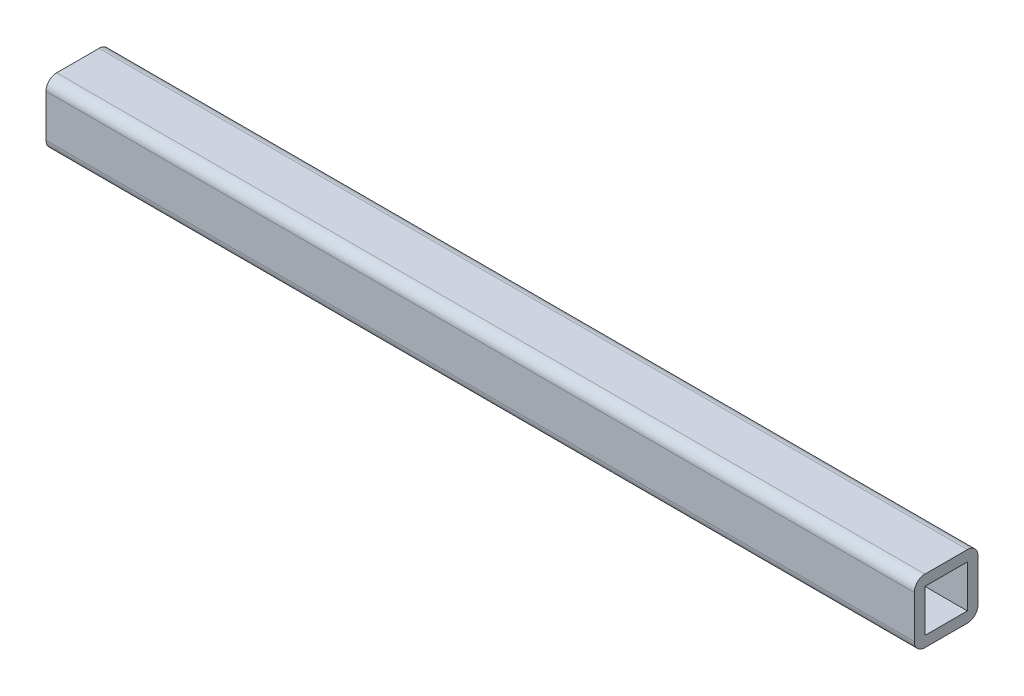
ISO-10303-21;
HEADER;
FILE_DESCRIPTION(('STEP AP214'),'2;1');
FILE_NAME('part.step','',(''),(''),'','','');
FILE_SCHEMA(('AUTOMOTIVE_DESIGN { 1 0 10303 214 1 1 1 1 }'));
ENDSEC;
DATA;
#1=APPLICATION_CONTEXT('core data for automotive mechanical design processes');
#2=APPLICATION_PROTOCOL_DEFINITION('international standard','automotive_design',2000,#1);
#3=PRODUCT_CONTEXT('',#1,'mechanical');
#4=PRODUCT('Part','Part','',(#3));
#5=PRODUCT_RELATED_PRODUCT_CATEGORY('part','',(#4));
#6=PRODUCT_DEFINITION_FORMATION('','',#4);
#7=PRODUCT_DEFINITION_CONTEXT('part definition',#1,'design');
#8=PRODUCT_DEFINITION('design','',#6,#7);
#9=PRODUCT_DEFINITION_SHAPE('','',#8);
#10=(LENGTH_UNIT() NAMED_UNIT(*) SI_UNIT(.MILLI.,.METRE.));
#11=(NAMED_UNIT(*) PLANE_ANGLE_UNIT() SI_UNIT($,.RADIAN.));
#12=(NAMED_UNIT(*) SI_UNIT($,.STERADIAN.) SOLID_ANGLE_UNIT());
#13=UNCERTAINTY_MEASURE_WITH_UNIT(LENGTH_MEASURE(1.E-05),#10,'distance_accuracy_value','');
#14=(GEOMETRIC_REPRESENTATION_CONTEXT(3) GLOBAL_UNCERTAINTY_ASSIGNED_CONTEXT((#13)) GLOBAL_UNIT_ASSIGNED_CONTEXT((#10,
#11,#12)) REPRESENTATION_CONTEXT('',''));
#15=CARTESIAN_POINT('',(0.,0.,0.));
#16=DIRECTION('',(0.,0.,1.));
#17=DIRECTION('',(1.,0.,0.));
#18=AXIS2_PLACEMENT_3D('',#15,#16,#17);
#19=CARTESIAN_POINT('',(259.55625,0.,0.));
#20=DIRECTION('',(-1.,0.,0.));
#21=DIRECTION('',(0.,0.,1.));
#22=AXIS2_PLACEMENT_3D('',#19,#20,#21);
#23=PLANE('',#22);
#24=DIRECTION('',(0.,0.,-1.));
#25=VECTOR('',#24,1.);
#26=CARTESIAN_POINT('',(259.55625,-19.05,19.05));
#27=LINE('',#26,#25);
#28=CARTESIAN_POINT('',(259.55625,-19.05,12.7));
#29=VERTEX_POINT('',#28);
#30=CARTESIAN_POINT('',(259.55625,-19.05,-12.7));
#31=VERTEX_POINT('',#30);
#32=EDGE_CURVE('E204',#29,#31,#27,.T.);
#33=ORIENTED_EDGE('',*,*,#32,.T.);
#34=CARTESIAN_POINT('',(259.55625,-12.7,-12.7));
#35=DIRECTION('',(-1.,0.,0.));
#36=DIRECTION('',(0.,0.,1.));
#37=AXIS2_PLACEMENT_3D('',#34,#35,#36);
#38=CIRCLE('',#37,6.35);
#39=CARTESIAN_POINT('',(259.55625,-12.7,-19.05));
#40=VERTEX_POINT('',#39);
#41=EDGE_CURVE('E255',#31,#40,#38,.F.);
#42=ORIENTED_EDGE('',*,*,#41,.T.);
#43=DIRECTION('',(0.,1.,0.));
#44=VECTOR('',#43,1.);
#45=CARTESIAN_POINT('',(259.55625,-19.05,-19.05));
#46=LINE('',#45,#44);
#47=CARTESIAN_POINT('',(259.55625,12.7,-19.05));
#48=VERTEX_POINT('',#47);
#49=EDGE_CURVE('E193',#40,#48,#46,.T.);
#50=ORIENTED_EDGE('',*,*,#49,.T.);
#51=CARTESIAN_POINT('',(259.55625,12.7,-12.7));
#52=DIRECTION('',(-1.,0.,0.));
#53=DIRECTION('',(0.,0.,1.));
#54=AXIS2_PLACEMENT_3D('',#51,#52,#53);
#55=CIRCLE('',#54,6.35);
#56=CARTESIAN_POINT('',(259.55625,19.05,-12.7));
#57=VERTEX_POINT('',#56);
#58=EDGE_CURVE('E249',#48,#57,#55,.F.);
#59=ORIENTED_EDGE('',*,*,#58,.T.);
#60=DIRECTION('',(0.,0.,1.));
#61=VECTOR('',#60,1.);
#62=CARTESIAN_POINT('',(259.55625,19.05,19.05));
#63=LINE('',#62,#61);
#64=CARTESIAN_POINT('',(259.55625,19.05,12.7));
#65=VERTEX_POINT('',#64);
#66=EDGE_CURVE('E197',#57,#65,#63,.T.);
#67=ORIENTED_EDGE('',*,*,#66,.T.);
#68=CARTESIAN_POINT('',(259.55625,12.7,12.7));
#69=DIRECTION('',(-1.,0.,0.));
#70=DIRECTION('',(0.,0.,1.));
#71=AXIS2_PLACEMENT_3D('',#68,#69,#70);
#72=CIRCLE('',#71,6.35);
#73=CARTESIAN_POINT('',(259.55625,12.7,19.05));
#74=VERTEX_POINT('',#73);
#75=EDGE_CURVE('E70',#65,#74,#72,.F.);
#76=ORIENTED_EDGE('',*,*,#75,.T.);
#77=DIRECTION('',(0.,-1.,0.));
#78=VECTOR('',#77,1.);
#79=CARTESIAN_POINT('',(259.55625,-19.05,19.05));
#80=LINE('',#79,#78);
#81=CARTESIAN_POINT('',(259.55625,-12.7,19.05));
#82=VERTEX_POINT('',#81);
#83=EDGE_CURVE('E201',#74,#82,#80,.T.);
#84=ORIENTED_EDGE('',*,*,#83,.T.);
#85=CARTESIAN_POINT('',(259.55625,-12.7,12.7));
#86=DIRECTION('',(-1.,0.,0.));
#87=DIRECTION('',(0.,0.,1.));
#88=AXIS2_PLACEMENT_3D('',#85,#86,#87);
#89=CIRCLE('',#88,6.35);
#90=EDGE_CURVE('E252',#82,#29,#89,.F.);
#91=ORIENTED_EDGE('',*,*,#90,.T.);
#92=EDGE_LOOP('',(#33,#42,#50,#59,#67,#76,#84,#91));
#93=FACE_BOUND('',#92,.T.);
#94=DIRECTION('',(0.,1.,0.));
#95=VECTOR('',#94,1.);
#96=CARTESIAN_POINT('',(259.55625,-12.7,-12.7));
#97=LINE('',#96,#95);
#98=CARTESIAN_POINT('',(259.55625,-12.7,-12.7));
#99=VERTEX_POINT('',#98);
#100=CARTESIAN_POINT('',(259.55625,12.7,-12.7));
#101=VERTEX_POINT('',#100);
#102=EDGE_CURVE('E140',#99,#101,#97,.T.);
#103=ORIENTED_EDGE('',*,*,#102,.F.);
#104=DIRECTION('',(0.,0.,-1.));
#105=VECTOR('',#104,1.);
#106=CARTESIAN_POINT('',(259.55625,-12.7,12.7));
#107=LINE('',#106,#105);
#108=CARTESIAN_POINT('',(259.55625,-12.7,12.7));
#109=VERTEX_POINT('',#108);
#110=EDGE_CURVE('E169',#109,#99,#107,.T.);
#111=ORIENTED_EDGE('',*,*,#110,.F.);
#112=DIRECTION('',(0.,-1.,0.));
#113=VECTOR('',#112,1.);
#114=CARTESIAN_POINT('',(259.55625,-12.7,12.7));
#115=LINE('',#114,#113);
#116=CARTESIAN_POINT('',(259.55625,12.7,12.7));
#117=VERTEX_POINT('',#116);
#118=EDGE_CURVE('E165',#117,#109,#115,.T.);
#119=ORIENTED_EDGE('',*,*,#118,.F.);
#120=DIRECTION('',(0.,0.,1.));
#121=VECTOR('',#120,1.);
#122=CARTESIAN_POINT('',(259.55625,12.7,12.7));
#123=LINE('',#122,#121);
#124=EDGE_CURVE('E151',#101,#117,#123,.T.);
#125=ORIENTED_EDGE('',*,*,#124,.F.);
#126=EDGE_LOOP('',(#103,#111,#119,#125));
#127=FACE_BOUND('',#126,.T.);
#128=ADVANCED_FACE('F47',(#93,#127),#23,.F.);
#129=CARTESIAN_POINT('',(-259.55625,0.,0.));
#130=DIRECTION('',(-1.,0.,0.));
#131=DIRECTION('',(0.,0.,1.));
#132=AXIS2_PLACEMENT_3D('',#129,#130,#131);
#133=PLANE('',#132);
#134=DIRECTION('',(0.,1.,0.));
#135=VECTOR('',#134,1.);
#136=CARTESIAN_POINT('',(-259.55625,-19.05,-19.05));
#137=LINE('',#136,#135);
#138=CARTESIAN_POINT('',(-259.55625,-12.7,-19.05));
#139=VERTEX_POINT('',#138);
#140=CARTESIAN_POINT('',(-259.55625,12.7,-19.05));
#141=VERTEX_POINT('',#140);
#142=EDGE_CURVE('E160',#139,#141,#137,.T.);
#143=ORIENTED_EDGE('',*,*,#142,.F.);
#144=CARTESIAN_POINT('',(-259.55625,-12.7,-12.7));
#145=DIRECTION('',(-1.,0.,0.));
#146=DIRECTION('',(0.,0.,1.));
#147=AXIS2_PLACEMENT_3D('',#144,#145,#146);
#148=CIRCLE('',#147,6.35);
#149=CARTESIAN_POINT('',(-259.55625,-19.05,-12.7));
#150=VERTEX_POINT('',#149);
#151=EDGE_CURVE('E237',#139,#150,#148,.T.);
#152=ORIENTED_EDGE('',*,*,#151,.T.);
#153=DIRECTION('',(0.,0.,-1.));
#154=VECTOR('',#153,1.);
#155=CARTESIAN_POINT('',(-259.55625,-19.05,19.05));
#156=LINE('',#155,#154);
#157=CARTESIAN_POINT('',(-259.55625,-19.05,12.7));
#158=VERTEX_POINT('',#157);
#159=EDGE_CURVE('E198',#158,#150,#156,.T.);
#160=ORIENTED_EDGE('',*,*,#159,.F.);
#161=CARTESIAN_POINT('',(-259.55625,-12.7,12.7));
#162=DIRECTION('',(-1.,0.,0.));
#163=DIRECTION('',(0.,0.,1.));
#164=AXIS2_PLACEMENT_3D('',#161,#162,#163);
#165=CIRCLE('',#164,6.35);
#166=CARTESIAN_POINT('',(-259.55625,-12.7,19.05));
#167=VERTEX_POINT('',#166);
#168=EDGE_CURVE('E234',#158,#167,#165,.T.);
#169=ORIENTED_EDGE('',*,*,#168,.T.);
#170=DIRECTION('',(0.,-1.,0.));
#171=VECTOR('',#170,1.);
#172=CARTESIAN_POINT('',(-259.55625,-19.05,19.05));
#173=LINE('',#172,#171);
#174=CARTESIAN_POINT('',(-259.55625,12.7,19.05));
#175=VERTEX_POINT('',#174);
#176=EDGE_CURVE('E216',#175,#167,#173,.T.);
#177=ORIENTED_EDGE('',*,*,#176,.F.);
#178=CARTESIAN_POINT('',(-259.55625,12.7,12.7));
#179=DIRECTION('',(-1.,0.,0.));
#180=DIRECTION('',(0.,0.,1.));
#181=AXIS2_PLACEMENT_3D('',#178,#179,#180);
#182=CIRCLE('',#181,6.35);
#183=CARTESIAN_POINT('',(-259.55625,19.05,12.7));
#184=VERTEX_POINT('',#183);
#185=EDGE_CURVE('E228',#175,#184,#182,.T.);
#186=ORIENTED_EDGE('',*,*,#185,.T.);
#187=DIRECTION('',(0.,0.,1.));
#188=VECTOR('',#187,1.);
#189=CARTESIAN_POINT('',(-259.55625,19.05,19.05));
#190=LINE('',#189,#188);
#191=CARTESIAN_POINT('',(-259.55625,19.05,-12.7));
#192=VERTEX_POINT('',#191);
#193=EDGE_CURVE('E212',#192,#184,#190,.T.);
#194=ORIENTED_EDGE('',*,*,#193,.F.);
#195=CARTESIAN_POINT('',(-259.55625,12.7,-12.7));
#196=DIRECTION('',(-1.,0.,0.));
#197=DIRECTION('',(0.,0.,1.));
#198=AXIS2_PLACEMENT_3D('',#195,#196,#197);
#199=CIRCLE('',#198,6.35);
#200=EDGE_CURVE('E231',#192,#141,#199,.T.);
#201=ORIENTED_EDGE('',*,*,#200,.T.);
#202=EDGE_LOOP('',(#143,#152,#160,#169,#177,#186,#194,#201));
#203=FACE_BOUND('',#202,.T.);
#204=DIRECTION('',(0.,0.,-1.));
#205=VECTOR('',#204,1.);
#206=CARTESIAN_POINT('',(-259.55625,-12.7,12.7));
#207=LINE('',#206,#205);
#208=CARTESIAN_POINT('',(-259.55625,-12.7,12.7));
#209=VERTEX_POINT('',#208);
#210=CARTESIAN_POINT('',(-259.55625,-12.7,-12.7));
#211=VERTEX_POINT('',#210);
#212=EDGE_CURVE('E152',#209,#211,#207,.T.);
#213=ORIENTED_EDGE('',*,*,#212,.T.);
#214=DIRECTION('',(0.,1.,0.));
#215=VECTOR('',#214,1.);
#216=CARTESIAN_POINT('',(-259.55625,-12.7,-12.7));
#217=LINE('',#216,#215);
#218=CARTESIAN_POINT('',(-259.55625,12.7,-12.7));
#219=VERTEX_POINT('',#218);
#220=EDGE_CURVE('E174',#211,#219,#217,.T.);
#221=ORIENTED_EDGE('',*,*,#220,.T.);
#222=DIRECTION('',(0.,0.,1.));
#223=VECTOR('',#222,1.);
#224=CARTESIAN_POINT('',(-259.55625,12.7,12.7));
#225=LINE('',#224,#223);
#226=CARTESIAN_POINT('',(-259.55625,12.7,12.7));
#227=VERTEX_POINT('',#226);
#228=EDGE_CURVE('E158',#219,#227,#225,.T.);
#229=ORIENTED_EDGE('',*,*,#228,.T.);
#230=DIRECTION('',(0.,-1.,0.));
#231=VECTOR('',#230,1.);
#232=CARTESIAN_POINT('',(-259.55625,-12.7,12.7));
#233=LINE('',#232,#231);
#234=EDGE_CURVE('E179',#227,#209,#233,.T.);
#235=ORIENTED_EDGE('',*,*,#234,.T.);
#236=EDGE_LOOP('',(#213,#221,#229,#235));
#237=FACE_BOUND('',#236,.T.);
#238=ADVANCED_FACE('F277',(#203,#237),#133,.T.);
#239=CARTESIAN_POINT('',(259.55625,-19.05,-19.05));
#240=DIRECTION('',(0.,0.,1.));
#241=DIRECTION('',(1.,0.,0.));
#242=AXIS2_PLACEMENT_3D('',#239,#240,#241);
#243=PLANE('',#242);
#244=ORIENTED_EDGE('',*,*,#49,.F.);
#245=DIRECTION('',(-1.,0.,0.));
#246=VECTOR('',#245,1.);
#247=CARTESIAN_POINT('',(259.55625,-12.7,-19.05));
#248=LINE('',#247,#246);
#249=EDGE_CURVE('E224',#40,#139,#248,.T.);
#250=ORIENTED_EDGE('',*,*,#249,.T.);
#251=ORIENTED_EDGE('',*,*,#142,.T.);
#252=DIRECTION('',(-1.,0.,0.));
#253=VECTOR('',#252,1.);
#254=CARTESIAN_POINT('',(259.55625,12.7,-19.05));
#255=LINE('',#254,#253);
#256=EDGE_CURVE('E208',#141,#48,#255,.F.);
#257=ORIENTED_EDGE('',*,*,#256,.T.);
#258=EDGE_LOOP('',(#244,#250,#251,#257));
#259=FACE_BOUND('',#258,.T.);
#260=ADVANCED_FACE('F294',(#259),#243,.F.);
#261=CARTESIAN_POINT('',(259.55625,19.05,19.05));
#262=DIRECTION('',(0.,-1.,0.));
#263=DIRECTION('',(0.,0.,-1.));
#264=AXIS2_PLACEMENT_3D('',#261,#262,#263);
#265=PLANE('',#264);
#266=ORIENTED_EDGE('',*,*,#66,.F.);
#267=DIRECTION('',(-1.,0.,0.));
#268=VECTOR('',#267,1.);
#269=CARTESIAN_POINT('',(259.55625,19.05,-12.7));
#270=LINE('',#269,#268);
#271=EDGE_CURVE('E11',#57,#192,#270,.T.);
#272=ORIENTED_EDGE('',*,*,#271,.T.);
#273=ORIENTED_EDGE('',*,*,#193,.T.);
#274=DIRECTION('',(-1.,0.,0.));
#275=VECTOR('',#274,1.);
#276=CARTESIAN_POINT('',(259.55625,19.05,12.7));
#277=LINE('',#276,#275);
#278=EDGE_CURVE('E56',#184,#65,#277,.F.);
#279=ORIENTED_EDGE('',*,*,#278,.T.);
#280=EDGE_LOOP('',(#266,#272,#273,#279));
#281=FACE_BOUND('',#280,.T.);
#282=ADVANCED_FACE('F267',(#281),#265,.F.);
#283=CARTESIAN_POINT('',(259.55625,-19.05,19.05));
#284=DIRECTION('',(0.,0.,-1.));
#285=DIRECTION('',(-1.,0.,0.));
#286=AXIS2_PLACEMENT_3D('',#283,#284,#285);
#287=PLANE('',#286);
#288=ORIENTED_EDGE('',*,*,#176,.T.);
#289=DIRECTION('',(-1.,0.,0.));
#290=VECTOR('',#289,1.);
#291=CARTESIAN_POINT('',(259.55625,-12.7,19.05));
#292=LINE('',#291,#290);
#293=EDGE_CURVE('E63',#167,#82,#292,.F.);
#294=ORIENTED_EDGE('',*,*,#293,.T.);
#295=ORIENTED_EDGE('',*,*,#83,.F.);
#296=DIRECTION('',(-1.,0.,0.));
#297=VECTOR('',#296,1.);
#298=CARTESIAN_POINT('',(259.55625,12.7,19.05));
#299=LINE('',#298,#297);
#300=EDGE_CURVE('E258',#74,#175,#299,.T.);
#301=ORIENTED_EDGE('',*,*,#300,.T.);
#302=EDGE_LOOP('',(#288,#294,#295,#301));
#303=FACE_BOUND('',#302,.T.);
#304=ADVANCED_FACE('F274',(#303),#287,.F.);
#305=CARTESIAN_POINT('',(259.55625,-19.05,19.05));
#306=DIRECTION('',(0.,1.,0.));
#307=DIRECTION('',(0.,0.,1.));
#308=AXIS2_PLACEMENT_3D('',#305,#306,#307);
#309=PLANE('',#308);
#310=ORIENTED_EDGE('',*,*,#159,.T.);
#311=DIRECTION('',(-1.,0.,0.));
#312=VECTOR('',#311,1.);
#313=CARTESIAN_POINT('',(259.55625,-19.05,-12.7));
#314=LINE('',#313,#312);
#315=EDGE_CURVE('E244',#150,#31,#314,.F.);
#316=ORIENTED_EDGE('',*,*,#315,.T.);
#317=ORIENTED_EDGE('',*,*,#32,.F.);
#318=DIRECTION('',(-1.,0.,0.));
#319=VECTOR('',#318,1.);
#320=CARTESIAN_POINT('',(259.55625,-19.05,12.7));
#321=LINE('',#320,#319);
#322=EDGE_CURVE('E240',#29,#158,#321,.T.);
#323=ORIENTED_EDGE('',*,*,#322,.T.);
#324=EDGE_LOOP('',(#310,#316,#317,#323));
#325=FACE_BOUND('',#324,.T.);
#326=ADVANCED_FACE('F286',(#325),#309,.F.);
#327=CARTESIAN_POINT('',(259.55625,-12.7,-12.7));
#328=DIRECTION('',(0.,0.,1.));
#329=DIRECTION('',(1.,0.,0.));
#330=AXIS2_PLACEMENT_3D('',#327,#328,#329);
#331=PLANE('',#330);
#332=ORIENTED_EDGE('',*,*,#220,.F.);
#333=DIRECTION('',(-1.,0.,0.));
#334=VECTOR('',#333,1.);
#335=CARTESIAN_POINT('',(259.55625,-12.7,-12.7));
#336=LINE('',#335,#334);
#337=EDGE_CURVE('E146',#99,#211,#336,.T.);
#338=ORIENTED_EDGE('',*,*,#337,.F.);
#339=ORIENTED_EDGE('',*,*,#102,.T.);
#340=DIRECTION('',(-1.,0.,0.));
#341=VECTOR('',#340,1.);
#342=CARTESIAN_POINT('',(259.55625,12.7,-12.7));
#343=LINE('',#342,#341);
#344=EDGE_CURVE('E143',#101,#219,#343,.T.);
#345=ORIENTED_EDGE('',*,*,#344,.T.);
#346=EDGE_LOOP('',(#332,#338,#339,#345));
#347=FACE_BOUND('',#346,.T.);
#348=ADVANCED_FACE('F142',(#347),#331,.T.);
#349=CARTESIAN_POINT('',(259.55625,12.7,12.7));
#350=DIRECTION('',(0.,-1.,0.));
#351=DIRECTION('',(0.,0.,-1.));
#352=AXIS2_PLACEMENT_3D('',#349,#350,#351);
#353=PLANE('',#352);
#354=ORIENTED_EDGE('',*,*,#228,.F.);
#355=ORIENTED_EDGE('',*,*,#344,.F.);
#356=ORIENTED_EDGE('',*,*,#124,.T.);
#357=DIRECTION('',(-1.,0.,0.));
#358=VECTOR('',#357,1.);
#359=CARTESIAN_POINT('',(259.55625,12.7,12.7));
#360=LINE('',#359,#358);
#361=EDGE_CURVE('E161',#117,#227,#360,.T.);
#362=ORIENTED_EDGE('',*,*,#361,.T.);
#363=EDGE_LOOP('',(#354,#355,#356,#362));
#364=FACE_BOUND('',#363,.T.);
#365=ADVANCED_FACE('F155',(#364),#353,.T.);
#366=CARTESIAN_POINT('',(259.55625,-12.7,12.7));
#367=DIRECTION('',(0.,0.,-1.));
#368=DIRECTION('',(-1.,0.,0.));
#369=AXIS2_PLACEMENT_3D('',#366,#367,#368);
#370=PLANE('',#369);
#371=ORIENTED_EDGE('',*,*,#234,.F.);
#372=ORIENTED_EDGE('',*,*,#361,.F.);
#373=ORIENTED_EDGE('',*,*,#118,.T.);
#374=DIRECTION('',(-1.,0.,0.));
#375=VECTOR('',#374,1.);
#376=CARTESIAN_POINT('',(259.55625,-12.7,12.7));
#377=LINE('',#376,#375);
#378=EDGE_CURVE('E188',#109,#209,#377,.T.);
#379=ORIENTED_EDGE('',*,*,#378,.T.);
#380=EDGE_LOOP('',(#371,#372,#373,#379));
#381=FACE_BOUND('',#380,.T.);
#382=ADVANCED_FACE('F326',(#381),#370,.T.);
#383=CARTESIAN_POINT('',(259.55625,-12.7,12.7));
#384=DIRECTION('',(0.,1.,0.));
#385=DIRECTION('',(0.,0.,1.));
#386=AXIS2_PLACEMENT_3D('',#383,#384,#385);
#387=PLANE('',#386);
#388=ORIENTED_EDGE('',*,*,#212,.F.);
#389=ORIENTED_EDGE('',*,*,#378,.F.);
#390=ORIENTED_EDGE('',*,*,#110,.T.);
#391=ORIENTED_EDGE('',*,*,#337,.T.);
#392=EDGE_LOOP('',(#388,#389,#390,#391));
#393=FACE_BOUND('',#392,.T.);
#394=ADVANCED_FACE('F323',(#393),#387,.T.);
#395=CARTESIAN_POINT('',(259.55625,-12.7,-12.7));
#396=DIRECTION('',(-1.,0.,0.));
#397=DIRECTION('',(0.,0.,1.));
#398=AXIS2_PLACEMENT_3D('',#395,#396,#397);
#399=CYLINDRICAL_SURFACE('',#398,6.35);
#400=ORIENTED_EDGE('',*,*,#41,.F.);
#401=ORIENTED_EDGE('',*,*,#315,.F.);
#402=ORIENTED_EDGE('',*,*,#151,.F.);
#403=ORIENTED_EDGE('',*,*,#249,.F.);
#404=EDGE_LOOP('',(#400,#401,#402,#403));
#405=FACE_BOUND('',#404,.T.);
#406=ADVANCED_FACE('F292',(#405),#399,.T.);
#407=CARTESIAN_POINT('',(259.55625,-12.7,12.7));
#408=DIRECTION('',(-1.,0.,0.));
#409=DIRECTION('',(0.,0.,1.));
#410=AXIS2_PLACEMENT_3D('',#407,#408,#409);
#411=CYLINDRICAL_SURFACE('',#410,6.35);
#412=ORIENTED_EDGE('',*,*,#90,.F.);
#413=ORIENTED_EDGE('',*,*,#293,.F.);
#414=ORIENTED_EDGE('',*,*,#168,.F.);
#415=ORIENTED_EDGE('',*,*,#322,.F.);
#416=EDGE_LOOP('',(#412,#413,#414,#415));
#417=FACE_BOUND('',#416,.T.);
#418=ADVANCED_FACE('F283',(#417),#411,.T.);
#419=CARTESIAN_POINT('',(259.55625,12.7,-12.7));
#420=DIRECTION('',(-1.,0.,0.));
#421=DIRECTION('',(0.,0.,1.));
#422=AXIS2_PLACEMENT_3D('',#419,#420,#421);
#423=CYLINDRICAL_SURFACE('',#422,6.35);
#424=ORIENTED_EDGE('',*,*,#58,.F.);
#425=ORIENTED_EDGE('',*,*,#256,.F.);
#426=ORIENTED_EDGE('',*,*,#200,.F.);
#427=ORIENTED_EDGE('',*,*,#271,.F.);
#428=EDGE_LOOP('',(#424,#425,#426,#427));
#429=FACE_BOUND('',#428,.T.);
#430=ADVANCED_FACE('F297',(#429),#423,.T.);
#431=CARTESIAN_POINT('',(259.55625,12.7,12.7));
#432=DIRECTION('',(-1.,0.,0.));
#433=DIRECTION('',(0.,0.,1.));
#434=AXIS2_PLACEMENT_3D('',#431,#432,#433);
#435=CYLINDRICAL_SURFACE('',#434,6.35);
#436=ORIENTED_EDGE('',*,*,#75,.F.);
#437=ORIENTED_EDGE('',*,*,#278,.F.);
#438=ORIENTED_EDGE('',*,*,#185,.F.);
#439=ORIENTED_EDGE('',*,*,#300,.F.);
#440=EDGE_LOOP('',(#436,#437,#438,#439));
#441=FACE_BOUND('',#440,.T.);
#442=ADVANCED_FACE('F49',(#441),#435,.T.);
#443=CLOSED_SHELL('',(#128,#238,#260,#282,#304,#326,#348,#365,#382,#394,#406,#418,#430,#442));
#444=MANIFOLD_SOLID_BREP('B2',#443);
#445=ADVANCED_BREP_SHAPE_REPRESENTATION('',(#18,#444),#14);
#446=SHAPE_DEFINITION_REPRESENTATION(#9,#445);
ENDSEC;
END-ISO-10303-21;
